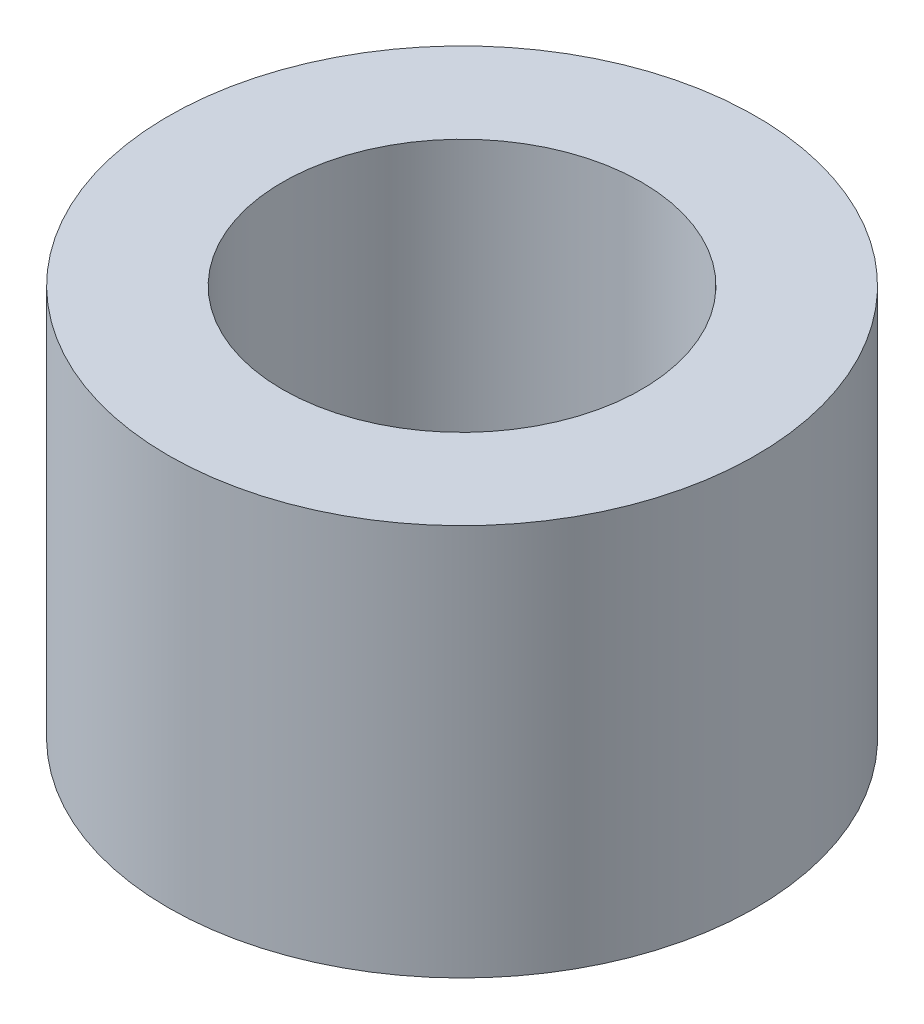
ISO-10303-21;
HEADER;
FILE_DESCRIPTION(('STEP AP214'),'2;1');
FILE_NAME('part.step','',(''),(''),'','','');
FILE_SCHEMA(('AUTOMOTIVE_DESIGN { 1 0 10303 214 1 1 1 1 }'));
ENDSEC;
DATA;
#1=APPLICATION_CONTEXT('core data for automotive mechanical design processes');
#2=APPLICATION_PROTOCOL_DEFINITION('international standard','automotive_design',2000,#1);
#3=PRODUCT_CONTEXT('',#1,'mechanical');
#4=PRODUCT('Part','Part','',(#3));
#5=PRODUCT_RELATED_PRODUCT_CATEGORY('part','',(#4));
#6=PRODUCT_DEFINITION_FORMATION('','',#4);
#7=PRODUCT_DEFINITION_CONTEXT('part definition',#1,'design');
#8=PRODUCT_DEFINITION('design','',#6,#7);
#9=PRODUCT_DEFINITION_SHAPE('','',#8);
#10=(LENGTH_UNIT() NAMED_UNIT(*) SI_UNIT(.MILLI.,.METRE.));
#11=(NAMED_UNIT(*) PLANE_ANGLE_UNIT() SI_UNIT($,.RADIAN.));
#12=(NAMED_UNIT(*) SI_UNIT($,.STERADIAN.) SOLID_ANGLE_UNIT());
#13=UNCERTAINTY_MEASURE_WITH_UNIT(LENGTH_MEASURE(1.E-05),#10,'distance_accuracy_value','');
#14=(GEOMETRIC_REPRESENTATION_CONTEXT(3) GLOBAL_UNCERTAINTY_ASSIGNED_CONTEXT((#13)) GLOBAL_UNIT_ASSIGNED_CONTEXT((#10,
#11,#12)) REPRESENTATION_CONTEXT('',''));
#15=CARTESIAN_POINT('',(0.,0.,0.));
#16=DIRECTION('',(0.,0.,1.));
#17=DIRECTION('',(1.,0.,0.));
#18=AXIS2_PLACEMENT_3D('',#15,#16,#17);
#19=CARTESIAN_POINT('',(0.,3.,0.));
#20=DIRECTION('',(0.,1.,0.));
#21=DIRECTION('',(0.,0.,1.));
#22=AXIS2_PLACEMENT_3D('',#19,#20,#21);
#23=PLANE('',#22);
#24=CARTESIAN_POINT('',(0.,3.,0.));
#25=DIRECTION('',(0.,1.,0.));
#26=DIRECTION('',(0.,0.,1.));
#27=AXIS2_PLACEMENT_3D('',#24,#25,#26);
#28=CIRCLE('',#27,2.249999945);
#29=CARTESIAN_POINT('',(0.,3.,2.249999945));
#30=VERTEX_POINT('',#29);
#31=EDGE_CURVE('E10',#30,#30,#28,.T.);
#32=ORIENTED_EDGE('',*,*,#31,.T.);
#33=EDGE_LOOP('',(#32));
#34=FACE_BOUND('',#33,.T.);
#35=CARTESIAN_POINT('',(0.,3.,0.));
#36=DIRECTION('',(0.,1.,0.));
#37=DIRECTION('',(0.,0.,1.));
#38=AXIS2_PLACEMENT_3D('',#35,#36,#37);
#39=CIRCLE('',#38,1.375000044);
#40=CARTESIAN_POINT('',(0.,3.,1.375000044));
#41=VERTEX_POINT('',#40);
#42=EDGE_CURVE('E42',#41,#41,#39,.T.);
#43=ORIENTED_EDGE('',*,*,#42,.F.);
#44=EDGE_LOOP('',(#43));
#45=FACE_BOUND('',#44,.T.);
#46=ADVANCED_FACE('F31',(#34,#45),#23,.T.);
#47=CARTESIAN_POINT('',(0.,0.,0.));
#48=DIRECTION('',(0.,1.,0.));
#49=DIRECTION('',(0.,0.,1.));
#50=AXIS2_PLACEMENT_3D('',#47,#48,#49);
#51=PLANE('',#50);
#52=CARTESIAN_POINT('',(0.,0.,0.));
#53=DIRECTION('',(0.,1.,0.));
#54=DIRECTION('',(0.,0.,1.));
#55=AXIS2_PLACEMENT_3D('',#52,#53,#54);
#56=CIRCLE('',#55,2.249999945);
#57=CARTESIAN_POINT('',(0.,0.,2.249999945));
#58=VERTEX_POINT('',#57);
#59=EDGE_CURVE('E35',#58,#58,#56,.T.);
#60=ORIENTED_EDGE('',*,*,#59,.F.);
#61=EDGE_LOOP('',(#60));
#62=FACE_BOUND('',#61,.T.);
#63=CARTESIAN_POINT('',(0.,0.,0.));
#64=DIRECTION('',(0.,1.,0.));
#65=DIRECTION('',(0.,0.,1.));
#66=AXIS2_PLACEMENT_3D('',#63,#64,#65);
#67=CIRCLE('',#66,1.375000044);
#68=CARTESIAN_POINT('',(0.,0.,1.375000044));
#69=VERTEX_POINT('',#68);
#70=EDGE_CURVE('E44',#69,#69,#67,.T.);
#71=ORIENTED_EDGE('',*,*,#70,.T.);
#72=EDGE_LOOP('',(#71));
#73=FACE_BOUND('',#72,.T.);
#74=ADVANCED_FACE('F54',(#62,#73),#51,.F.);
#75=CARTESIAN_POINT('',(0.,3.,0.));
#76=DIRECTION('',(0.,-1.,0.));
#77=DIRECTION('',(0.,0.,-1.));
#78=AXIS2_PLACEMENT_3D('',#75,#76,#77);
#79=CYLINDRICAL_SURFACE('',#78,2.249999945);
#80=ORIENTED_EDGE('',*,*,#31,.F.);
#81=EDGE_LOOP('',(#80));
#82=FACE_BOUND('',#81,.T.);
#83=ORIENTED_EDGE('',*,*,#59,.T.);
#84=EDGE_LOOP('',(#83));
#85=FACE_BOUND('',#84,.T.);
#86=ADVANCED_FACE('F33',(#82,#85),#79,.T.);
#87=CARTESIAN_POINT('',(0.,3.,0.));
#88=DIRECTION('',(0.,-1.,0.));
#89=DIRECTION('',(0.,0.,-1.));
#90=AXIS2_PLACEMENT_3D('',#87,#88,#89);
#91=CYLINDRICAL_SURFACE('',#90,1.375000044);
#92=ORIENTED_EDGE('',*,*,#42,.T.);
#93=EDGE_LOOP('',(#92));
#94=FACE_BOUND('',#93,.T.);
#95=ORIENTED_EDGE('',*,*,#70,.F.);
#96=EDGE_LOOP('',(#95));
#97=FACE_BOUND('',#96,.T.);
#98=ADVANCED_FACE('F50',(#94,#97),#91,.F.);
#99=CLOSED_SHELL('',(#46,#74,#86,#98));
#100=MANIFOLD_SOLID_BREP('B2',#99);
#101=ADVANCED_BREP_SHAPE_REPRESENTATION('',(#18,#100),#14);
#102=SHAPE_DEFINITION_REPRESENTATION(#9,#101);
ENDSEC;
END-ISO-10303-21;
